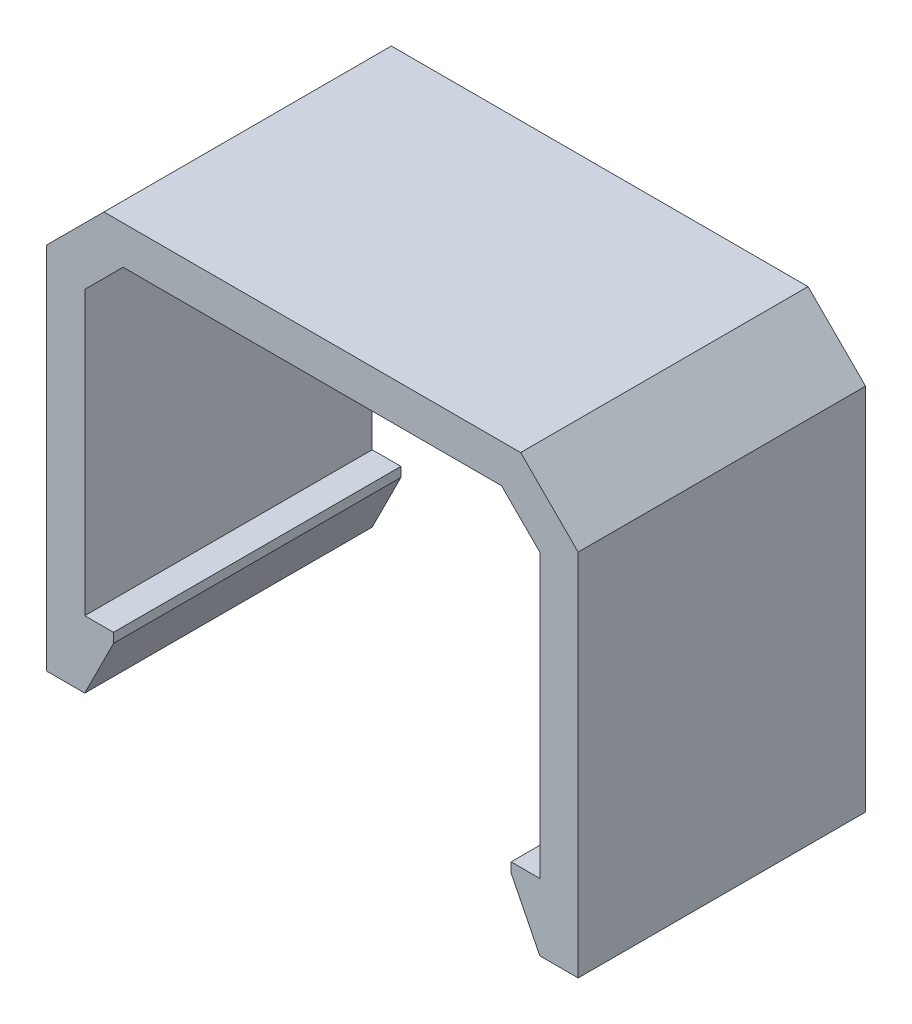
ISO-10303-21;
HEADER;
FILE_DESCRIPTION(('STEP AP214'),'2;1');
FILE_NAME('part.step','',(''),(''),'','','');
FILE_SCHEMA(('AUTOMOTIVE_DESIGN { 1 0 10303 214 1 1 1 1 }'));
ENDSEC;
DATA;
#1=APPLICATION_CONTEXT('core data for automotive mechanical design processes');
#2=APPLICATION_PROTOCOL_DEFINITION('international standard','automotive_design',2000,#1);
#3=PRODUCT_CONTEXT('',#1,'mechanical');
#4=PRODUCT('Part','Part','',(#3));
#5=PRODUCT_RELATED_PRODUCT_CATEGORY('part','',(#4));
#6=PRODUCT_DEFINITION_FORMATION('','',#4);
#7=PRODUCT_DEFINITION_CONTEXT('part definition',#1,'design');
#8=PRODUCT_DEFINITION('design','',#6,#7);
#9=PRODUCT_DEFINITION_SHAPE('','',#8);
#10=(LENGTH_UNIT() NAMED_UNIT(*) SI_UNIT(.MILLI.,.METRE.));
#11=(NAMED_UNIT(*) PLANE_ANGLE_UNIT() SI_UNIT($,.RADIAN.));
#12=(NAMED_UNIT(*) SI_UNIT($,.STERADIAN.) SOLID_ANGLE_UNIT());
#13=UNCERTAINTY_MEASURE_WITH_UNIT(LENGTH_MEASURE(1.E-05),#10,'distance_accuracy_value','');
#14=(GEOMETRIC_REPRESENTATION_CONTEXT(3) GLOBAL_UNCERTAINTY_ASSIGNED_CONTEXT((#13)) GLOBAL_UNIT_ASSIGNED_CONTEXT((#10,
#11,#12)) REPRESENTATION_CONTEXT('',''));
#15=CARTESIAN_POINT('',(0.,0.,0.));
#16=DIRECTION('',(0.,0.,1.));
#17=DIRECTION('',(1.,0.,0.));
#18=AXIS2_PLACEMENT_3D('',#15,#16,#17);
#19=CARTESIAN_POINT('',(0.,18.75,15.));
#20=DIRECTION('',(0.,-1.,0.));
#21=DIRECTION('',(0.,0.,-1.));
#22=AXIS2_PLACEMENT_3D('',#19,#20,#21);
#23=PLANE('',#22);
#24=DIRECTION('',(-1.,0.,0.));
#25=VECTOR('',#24,1.);
#26=CARTESIAN_POINT('',(0.,18.75,15.));
#27=LINE('',#26,#25);
#28=CARTESIAN_POINT('',(22.75,18.75,15.));
#29=VERTEX_POINT('',#28);
#30=CARTESIAN_POINT('',(1.00000000000001,18.75,15.));
#31=VERTEX_POINT('',#30);
#32=EDGE_CURVE('E197',#29,#31,#27,.T.);
#33=ORIENTED_EDGE('',*,*,#32,.F.);
#34=DIRECTION('',(0.,0.,-1.));
#35=VECTOR('',#34,1.);
#36=CARTESIAN_POINT('',(22.75,18.75,0.));
#37=LINE('',#36,#35);
#38=CARTESIAN_POINT('',(22.75,18.75,0.));
#39=VERTEX_POINT('',#38);
#40=EDGE_CURVE('E209',#29,#39,#37,.T.);
#41=ORIENTED_EDGE('',*,*,#40,.T.);
#42=DIRECTION('',(-1.,0.,0.));
#43=VECTOR('',#42,1.);
#44=CARTESIAN_POINT('',(0.,18.75,0.));
#45=LINE('',#44,#43);
#46=CARTESIAN_POINT('',(1.00000000000001,18.75,0.));
#47=VERTEX_POINT('',#46);
#48=EDGE_CURVE('E373',#39,#47,#45,.T.);
#49=ORIENTED_EDGE('',*,*,#48,.T.);
#50=DIRECTION('',(0.,0.,1.));
#51=VECTOR('',#50,1.);
#52=CARTESIAN_POINT('',(1.00000000000001,18.75,15.));
#53=LINE('',#52,#51);
#54=EDGE_CURVE('E204',#47,#31,#53,.T.);
#55=ORIENTED_EDGE('',*,*,#54,.T.);
#56=EDGE_LOOP('',(#33,#41,#49,#55));
#57=FACE_BOUND('',#56,.T.);
#58=ADVANCED_FACE('F47',(#57),#23,.F.);
#59=CARTESIAN_POINT('',(-2.,0.,15.));
#60=DIRECTION('',(1.,0.,0.));
#61=DIRECTION('',(0.,1.,0.));
#62=AXIS2_PLACEMENT_3D('',#59,#60,#61);
#63=PLANE('',#62);
#64=DIRECTION('',(0.,-1.,0.));
#65=VECTOR('',#64,1.);
#66=CARTESIAN_POINT('',(-2.,0.,15.));
#67=LINE('',#66,#65);
#68=CARTESIAN_POINT('',(-2.,15.75,15.));
#69=VERTEX_POINT('',#68);
#70=CARTESIAN_POINT('',(-2.,-3.5,15.));
#71=VERTEX_POINT('',#70);
#72=EDGE_CURVE('E186',#69,#71,#67,.T.);
#73=ORIENTED_EDGE('',*,*,#72,.F.);
#74=DIRECTION('',(0.,0.,-1.));
#75=VECTOR('',#74,1.);
#76=CARTESIAN_POINT('',(-2.,15.75,15.));
#77=LINE('',#76,#75);
#78=CARTESIAN_POINT('',(-2.,15.75,0.));
#79=VERTEX_POINT('',#78);
#80=EDGE_CURVE('E232',#69,#79,#77,.T.);
#81=ORIENTED_EDGE('',*,*,#80,.T.);
#82=DIRECTION('',(0.,-1.,0.));
#83=VECTOR('',#82,1.);
#84=CARTESIAN_POINT('',(-2.,0.,0.));
#85=LINE('',#84,#83);
#86=CARTESIAN_POINT('',(-2.,-3.5,0.));
#87=VERTEX_POINT('',#86);
#88=EDGE_CURVE('E202',#79,#87,#85,.T.);
#89=ORIENTED_EDGE('',*,*,#88,.T.);
#90=DIRECTION('',(0.,0.,-1.));
#91=VECTOR('',#90,1.);
#92=CARTESIAN_POINT('',(-2.,-3.5,15.));
#93=LINE('',#92,#91);
#94=EDGE_CURVE('E179',#71,#87,#93,.T.);
#95=ORIENTED_EDGE('',*,*,#94,.F.);
#96=EDGE_LOOP('',(#73,#81,#89,#95));
#97=FACE_BOUND('',#96,.T.);
#98=ADVANCED_FACE('F200',(#97),#63,.F.);
#99=CARTESIAN_POINT('',(0.,-3.5,15.));
#100=DIRECTION('',(0.,-1.,0.));
#101=DIRECTION('',(1.,0.,0.));
#102=AXIS2_PLACEMENT_3D('',#99,#100,#101);
#103=PLANE('',#102);
#104=DIRECTION('',(-1.,0.,0.));
#105=VECTOR('',#104,1.);
#106=CARTESIAN_POINT('',(0.,-3.5,0.));
#107=LINE('',#106,#105);
#108=CARTESIAN_POINT('',(0.,-3.5,0.));
#109=VERTEX_POINT('',#108);
#110=EDGE_CURVE('E341',#109,#87,#107,.T.);
#111=ORIENTED_EDGE('',*,*,#110,.F.);
#112=DIRECTION('',(0.,0.,1.));
#113=VECTOR('',#112,1.);
#114=CARTESIAN_POINT('',(0.,-3.5,15.));
#115=LINE('',#114,#113);
#116=CARTESIAN_POINT('',(0.,-3.5,15.));
#117=VERTEX_POINT('',#116);
#118=EDGE_CURVE('E181',#109,#117,#115,.T.);
#119=ORIENTED_EDGE('',*,*,#118,.T.);
#120=DIRECTION('',(-1.,0.,0.));
#121=VECTOR('',#120,1.);
#122=CARTESIAN_POINT('',(0.,-3.5,15.));
#123=LINE('',#122,#121);
#124=EDGE_CURVE('E174',#117,#71,#123,.T.);
#125=ORIENTED_EDGE('',*,*,#124,.T.);
#126=ORIENTED_EDGE('',*,*,#94,.T.);
#127=EDGE_LOOP('',(#111,#119,#125,#126));
#128=FACE_BOUND('',#127,.T.);
#129=ADVANCED_FACE('F177',(#128),#103,.T.);
#130=CARTESIAN_POINT('',(1.5,0.,15.));
#131=DIRECTION('',(1.,0.,0.));
#132=DIRECTION('',(0.,1.,0.));
#133=AXIS2_PLACEMENT_3D('',#130,#131,#132);
#134=PLANE('',#133);
#135=DIRECTION('',(0.,-1.,0.));
#136=VECTOR('',#135,1.);
#137=CARTESIAN_POINT('',(1.5,0.,15.));
#138=LINE('',#137,#136);
#139=CARTESIAN_POINT('',(1.5,0.,15.));
#140=VERTEX_POINT('',#139);
#141=CARTESIAN_POINT('',(1.5,-0.499999999999976,15.));
#142=VERTEX_POINT('',#141);
#143=EDGE_CURVE('E185',#140,#142,#138,.T.);
#144=ORIENTED_EDGE('',*,*,#143,.T.);
#145=DIRECTION('',(0.,0.,-1.));
#146=VECTOR('',#145,1.);
#147=CARTESIAN_POINT('',(1.5,-0.499999999999976,15.));
#148=LINE('',#147,#146);
#149=CARTESIAN_POINT('',(1.5,-0.499999999999976,0.));
#150=VERTEX_POINT('',#149);
#151=EDGE_CURVE('E261',#142,#150,#148,.T.);
#152=ORIENTED_EDGE('',*,*,#151,.T.);
#153=DIRECTION('',(0.,-1.,0.));
#154=VECTOR('',#153,1.);
#155=CARTESIAN_POINT('',(1.5,0.,0.));
#156=LINE('',#155,#154);
#157=CARTESIAN_POINT('',(1.5,0.,0.));
#158=VERTEX_POINT('',#157);
#159=EDGE_CURVE('E338',#158,#150,#156,.T.);
#160=ORIENTED_EDGE('',*,*,#159,.F.);
#161=DIRECTION('',(0.,0.,-1.));
#162=VECTOR('',#161,1.);
#163=CARTESIAN_POINT('',(1.5,0.,15.));
#164=LINE('',#163,#162);
#165=EDGE_CURVE('E205',#140,#158,#164,.T.);
#166=ORIENTED_EDGE('',*,*,#165,.F.);
#167=EDGE_LOOP('',(#144,#152,#160,#166));
#168=FACE_BOUND('',#167,.T.);
#169=ADVANCED_FACE('F385',(#168),#134,.T.);
#170=CARTESIAN_POINT('',(0.,0.,15.));
#171=DIRECTION('',(0.,1.,0.));
#172=DIRECTION('',(0.,0.,1.));
#173=AXIS2_PLACEMENT_3D('',#170,#171,#172);
#174=PLANE('',#173);
#175=DIRECTION('',(1.,0.,0.));
#176=VECTOR('',#175,1.);
#177=CARTESIAN_POINT('',(0.,0.,0.));
#178=LINE('',#177,#176);
#179=CARTESIAN_POINT('',(0.,0.,0.));
#180=VERTEX_POINT('',#179);
#181=EDGE_CURVE('E330',#180,#158,#178,.T.);
#182=ORIENTED_EDGE('',*,*,#181,.F.);
#183=DIRECTION('',(0.,0.,-1.));
#184=VECTOR('',#183,1.);
#185=CARTESIAN_POINT('',(0.,0.,15.));
#186=LINE('',#185,#184);
#187=CARTESIAN_POINT('',(0.,0.,15.));
#188=VERTEX_POINT('',#187);
#189=EDGE_CURVE('E211',#188,#180,#186,.T.);
#190=ORIENTED_EDGE('',*,*,#189,.F.);
#191=DIRECTION('',(1.,0.,0.));
#192=VECTOR('',#191,1.);
#193=CARTESIAN_POINT('',(0.,0.,15.));
#194=LINE('',#193,#192);
#195=EDGE_CURVE('E387',#188,#140,#194,.T.);
#196=ORIENTED_EDGE('',*,*,#195,.T.);
#197=ORIENTED_EDGE('',*,*,#165,.T.);
#198=EDGE_LOOP('',(#182,#190,#196,#197));
#199=FACE_BOUND('',#198,.T.);
#200=ADVANCED_FACE('F335',(#199),#174,.T.);
#201=CARTESIAN_POINT('',(0.,0.,15.));
#202=DIRECTION('',(-1.,0.,0.));
#203=DIRECTION('',(0.,0.,1.));
#204=AXIS2_PLACEMENT_3D('',#201,#202,#203);
#205=PLANE('',#204);
#206=DIRECTION('',(0.,1.,0.));
#207=VECTOR('',#206,1.);
#208=CARTESIAN_POINT('',(0.,0.,0.));
#209=LINE('',#208,#207);
#210=CARTESIAN_POINT('',(0.,14.75,0.));
#211=VERTEX_POINT('',#210);
#212=EDGE_CURVE('E320',#180,#211,#209,.T.);
#213=ORIENTED_EDGE('',*,*,#212,.T.);
#214=DIRECTION('',(0.,0.,1.));
#215=VECTOR('',#214,1.);
#216=CARTESIAN_POINT('',(0.,14.75,15.));
#217=LINE('',#216,#215);
#218=CARTESIAN_POINT('',(0.,14.75,15.));
#219=VERTEX_POINT('',#218);
#220=EDGE_CURVE('E246',#211,#219,#217,.T.);
#221=ORIENTED_EDGE('',*,*,#220,.T.);
#222=DIRECTION('',(0.,1.,0.));
#223=VECTOR('',#222,1.);
#224=CARTESIAN_POINT('',(0.,0.,15.));
#225=LINE('',#224,#223);
#226=EDGE_CURVE('E323',#188,#219,#225,.T.);
#227=ORIENTED_EDGE('',*,*,#226,.F.);
#228=ORIENTED_EDGE('',*,*,#189,.T.);
#229=EDGE_LOOP('',(#213,#221,#227,#228));
#230=FACE_BOUND('',#229,.T.);
#231=ADVANCED_FACE('F319',(#230),#205,.F.);
#232=CARTESIAN_POINT('',(0.,16.75,15.));
#233=DIRECTION('',(0.,1.,0.));
#234=DIRECTION('',(0.,0.,1.));
#235=AXIS2_PLACEMENT_3D('',#232,#233,#234);
#236=PLANE('',#235);
#237=DIRECTION('',(1.,0.,0.));
#238=VECTOR('',#237,1.);
#239=CARTESIAN_POINT('',(0.,16.75,0.));
#240=LINE('',#239,#238);
#241=CARTESIAN_POINT('',(2.00000000000002,16.75,0.));
#242=VERTEX_POINT('',#241);
#243=CARTESIAN_POINT('',(21.75,16.75,0.));
#244=VERTEX_POINT('',#243);
#245=EDGE_CURVE('E333',#242,#244,#240,.T.);
#246=ORIENTED_EDGE('',*,*,#245,.T.);
#247=DIRECTION('',(0.,0.,1.));
#248=VECTOR('',#247,1.);
#249=CARTESIAN_POINT('',(21.75,16.75,15.));
#250=LINE('',#249,#248);
#251=CARTESIAN_POINT('',(21.75,16.75,15.));
#252=VERTEX_POINT('',#251);
#253=EDGE_CURVE('E243',#244,#252,#250,.T.);
#254=ORIENTED_EDGE('',*,*,#253,.T.);
#255=DIRECTION('',(1.,0.,0.));
#256=VECTOR('',#255,1.);
#257=CARTESIAN_POINT('',(0.,16.75,15.));
#258=LINE('',#257,#256);
#259=CARTESIAN_POINT('',(2.00000000000002,16.75,15.));
#260=VERTEX_POINT('',#259);
#261=EDGE_CURVE('E394',#260,#252,#258,.T.);
#262=ORIENTED_EDGE('',*,*,#261,.F.);
#263=DIRECTION('',(0.,0.,-1.));
#264=VECTOR('',#263,1.);
#265=CARTESIAN_POINT('',(2.00000000000002,16.75,0.));
#266=LINE('',#265,#264);
#267=EDGE_CURVE('E239',#260,#242,#266,.T.);
#268=ORIENTED_EDGE('',*,*,#267,.T.);
#269=EDGE_LOOP('',(#246,#254,#262,#268));
#270=FACE_BOUND('',#269,.T.);
#271=ADVANCED_FACE('F406',(#270),#236,.F.);
#272=CARTESIAN_POINT('',(23.75,0.,15.));
#273=DIRECTION('',(1.,0.,0.));
#274=DIRECTION('',(0.,0.,-1.));
#275=AXIS2_PLACEMENT_3D('',#272,#273,#274);
#276=PLANE('',#275);
#277=DIRECTION('',(0.,-1.,0.));
#278=VECTOR('',#277,1.);
#279=CARTESIAN_POINT('',(23.75,0.,15.));
#280=LINE('',#279,#278);
#281=CARTESIAN_POINT('',(23.75,14.75,15.));
#282=VERTEX_POINT('',#281);
#283=CARTESIAN_POINT('',(23.75,0.,15.));
#284=VERTEX_POINT('',#283);
#285=EDGE_CURVE('E366',#282,#284,#280,.T.);
#286=ORIENTED_EDGE('',*,*,#285,.F.);
#287=DIRECTION('',(0.,0.,-1.));
#288=VECTOR('',#287,1.);
#289=CARTESIAN_POINT('',(23.75,14.75,0.));
#290=LINE('',#289,#288);
#291=CARTESIAN_POINT('',(23.75,14.75,0.));
#292=VERTEX_POINT('',#291);
#293=EDGE_CURVE('E235',#282,#292,#290,.T.);
#294=ORIENTED_EDGE('',*,*,#293,.T.);
#295=DIRECTION('',(0.,-1.,0.));
#296=VECTOR('',#295,1.);
#297=CARTESIAN_POINT('',(23.75,0.,0.));
#298=LINE('',#297,#296);
#299=CARTESIAN_POINT('',(23.75,0.,0.));
#300=VERTEX_POINT('',#299);
#301=EDGE_CURVE('E348',#292,#300,#298,.T.);
#302=ORIENTED_EDGE('',*,*,#301,.T.);
#303=DIRECTION('',(0.,0.,-1.));
#304=VECTOR('',#303,1.);
#305=CARTESIAN_POINT('',(23.75,0.,15.));
#306=LINE('',#305,#304);
#307=EDGE_CURVE('E311',#284,#300,#306,.T.);
#308=ORIENTED_EDGE('',*,*,#307,.F.);
#309=EDGE_LOOP('',(#286,#294,#302,#308));
#310=FACE_BOUND('',#309,.T.);
#311=ADVANCED_FACE('F402',(#310),#276,.F.);
#312=CARTESIAN_POINT('',(0.,0.,15.));
#313=DIRECTION('',(0.,-1.,0.));
#314=DIRECTION('',(0.,0.,-1.));
#315=AXIS2_PLACEMENT_3D('',#312,#313,#314);
#316=PLANE('',#315);
#317=DIRECTION('',(-1.,0.,0.));
#318=VECTOR('',#317,1.);
#319=CARTESIAN_POINT('',(0.,0.,0.));
#320=LINE('',#319,#318);
#321=CARTESIAN_POINT('',(22.25,0.,0.));
#322=VERTEX_POINT('',#321);
#323=EDGE_CURVE('E299',#300,#322,#320,.T.);
#324=ORIENTED_EDGE('',*,*,#323,.T.);
#325=DIRECTION('',(0.,0.,-1.));
#326=VECTOR('',#325,1.);
#327=CARTESIAN_POINT('',(22.25,0.,15.));
#328=LINE('',#327,#326);
#329=CARTESIAN_POINT('',(22.25,0.,15.));
#330=VERTEX_POINT('',#329);
#331=EDGE_CURVE('E306',#330,#322,#328,.T.);
#332=ORIENTED_EDGE('',*,*,#331,.F.);
#333=DIRECTION('',(-1.,0.,0.));
#334=VECTOR('',#333,1.);
#335=CARTESIAN_POINT('',(0.,0.,15.));
#336=LINE('',#335,#334);
#337=EDGE_CURVE('E361',#284,#330,#336,.T.);
#338=ORIENTED_EDGE('',*,*,#337,.F.);
#339=ORIENTED_EDGE('',*,*,#307,.T.);
#340=EDGE_LOOP('',(#324,#332,#338,#339));
#341=FACE_BOUND('',#340,.T.);
#342=ADVANCED_FACE('F354',(#341),#316,.F.);
#343=CARTESIAN_POINT('',(22.25,0.,15.));
#344=DIRECTION('',(1.,0.,0.));
#345=DIRECTION('',(0.,1.,0.));
#346=AXIS2_PLACEMENT_3D('',#343,#344,#345);
#347=PLANE('',#346);
#348=DIRECTION('',(0.,-1.,0.));
#349=VECTOR('',#348,1.);
#350=CARTESIAN_POINT('',(22.25,0.,0.));
#351=LINE('',#350,#349);
#352=CARTESIAN_POINT('',(22.25,-0.499999999999983,0.));
#353=VERTEX_POINT('',#352);
#354=EDGE_CURVE('E294',#322,#353,#351,.T.);
#355=ORIENTED_EDGE('',*,*,#354,.T.);
#356=DIRECTION('',(0.,0.,1.));
#357=VECTOR('',#356,1.);
#358=CARTESIAN_POINT('',(22.25,-0.499999999999983,15.));
#359=LINE('',#358,#357);
#360=CARTESIAN_POINT('',(22.25,-0.499999999999983,15.));
#361=VERTEX_POINT('',#360);
#362=EDGE_CURVE('E57',#353,#361,#359,.T.);
#363=ORIENTED_EDGE('',*,*,#362,.T.);
#364=DIRECTION('',(0.,-1.,0.));
#365=VECTOR('',#364,1.);
#366=CARTESIAN_POINT('',(22.25,0.,15.));
#367=LINE('',#366,#365);
#368=EDGE_CURVE('E359',#330,#361,#367,.T.);
#369=ORIENTED_EDGE('',*,*,#368,.F.);
#370=ORIENTED_EDGE('',*,*,#331,.T.);
#371=EDGE_LOOP('',(#355,#363,#369,#370));
#372=FACE_BOUND('',#371,.T.);
#373=ADVANCED_FACE('F358',(#372),#347,.F.);
#374=CARTESIAN_POINT('',(0.,-3.5,15.));
#375=DIRECTION('',(0.,1.,0.));
#376=DIRECTION('',(-1.,0.,0.));
#377=AXIS2_PLACEMENT_3D('',#374,#375,#376);
#378=PLANE('',#377);
#379=DIRECTION('',(1.,0.,0.));
#380=VECTOR('',#379,1.);
#381=CARTESIAN_POINT('',(0.,-3.5,15.));
#382=LINE('',#381,#380);
#383=CARTESIAN_POINT('',(23.75,-3.5,15.));
#384=VERTEX_POINT('',#383);
#385=CARTESIAN_POINT('',(25.75,-3.5,15.));
#386=VERTEX_POINT('',#385);
#387=EDGE_CURVE('E286',#384,#386,#382,.T.);
#388=ORIENTED_EDGE('',*,*,#387,.F.);
#389=DIRECTION('',(0.,0.,-1.));
#390=VECTOR('',#389,1.);
#391=CARTESIAN_POINT('',(23.75,-3.5,15.));
#392=LINE('',#391,#390);
#393=CARTESIAN_POINT('',(23.75,-3.5,0.));
#394=VERTEX_POINT('',#393);
#395=EDGE_CURVE('E273',#384,#394,#392,.T.);
#396=ORIENTED_EDGE('',*,*,#395,.T.);
#397=DIRECTION('',(1.,0.,0.));
#398=VECTOR('',#397,1.);
#399=CARTESIAN_POINT('',(0.,-3.5,0.));
#400=LINE('',#399,#398);
#401=CARTESIAN_POINT('',(25.75,-3.5,0.));
#402=VERTEX_POINT('',#401);
#403=EDGE_CURVE('E284',#394,#402,#400,.T.);
#404=ORIENTED_EDGE('',*,*,#403,.T.);
#405=DIRECTION('',(0.,0.,-1.));
#406=VECTOR('',#405,1.);
#407=CARTESIAN_POINT('',(25.75,-3.5,15.));
#408=LINE('',#407,#406);
#409=EDGE_CURVE('E303',#386,#402,#408,.T.);
#410=ORIENTED_EDGE('',*,*,#409,.F.);
#411=EDGE_LOOP('',(#388,#396,#404,#410));
#412=FACE_BOUND('',#411,.T.);
#413=ADVANCED_FACE('F282',(#412),#378,.F.);
#414=CARTESIAN_POINT('',(25.75,0.,15.));
#415=DIRECTION('',(1.,0.,0.));
#416=DIRECTION('',(0.,1.,0.));
#417=AXIS2_PLACEMENT_3D('',#414,#415,#416);
#418=PLANE('',#417);
#419=DIRECTION('',(0.,-1.,0.));
#420=VECTOR('',#419,1.);
#421=CARTESIAN_POINT('',(25.75,0.,0.));
#422=LINE('',#421,#420);
#423=CARTESIAN_POINT('',(25.75,15.75,0.));
#424=VERTEX_POINT('',#423);
#425=EDGE_CURVE('E291',#424,#402,#422,.T.);
#426=ORIENTED_EDGE('',*,*,#425,.F.);
#427=DIRECTION('',(0.,0.,1.));
#428=VECTOR('',#427,1.);
#429=CARTESIAN_POINT('',(25.75,15.75,15.));
#430=LINE('',#429,#428);
#431=CARTESIAN_POINT('',(25.75,15.75,15.));
#432=VERTEX_POINT('',#431);
#433=EDGE_CURVE('E224',#424,#432,#430,.T.);
#434=ORIENTED_EDGE('',*,*,#433,.T.);
#435=DIRECTION('',(0.,-1.,0.));
#436=VECTOR('',#435,1.);
#437=CARTESIAN_POINT('',(25.75,0.,15.));
#438=LINE('',#437,#436);
#439=EDGE_CURVE('E307',#432,#386,#438,.T.);
#440=ORIENTED_EDGE('',*,*,#439,.T.);
#441=ORIENTED_EDGE('',*,*,#409,.T.);
#442=EDGE_LOOP('',(#426,#434,#440,#441));
#443=FACE_BOUND('',#442,.T.);
#444=ADVANCED_FACE('F461',(#443),#418,.T.);
#445=CARTESIAN_POINT('',(0.,0.,15.));
#446=DIRECTION('',(0.,0.,1.));
#447=DIRECTION('',(1.,0.,0.));
#448=AXIS2_PLACEMENT_3D('',#445,#446,#447);
#449=PLANE('',#448);
#450=ORIENTED_EDGE('',*,*,#368,.T.);
#451=DIRECTION('',(-0.447213595499955,0.894427190999917,0.));
#452=VECTOR('',#451,1.);
#453=CARTESIAN_POINT('',(17.6000000000001,8.79999999999997,15.));
#454=LINE('',#453,#452);
#455=EDGE_CURVE('E11',#361,#384,#454,.F.);
#456=ORIENTED_EDGE('',*,*,#455,.T.);
#457=ORIENTED_EDGE('',*,*,#387,.T.);
#458=ORIENTED_EDGE('',*,*,#439,.F.);
#459=DIRECTION('',(-0.707106781186546,0.707106781186549,0.));
#460=VECTOR('',#459,1.);
#461=CARTESIAN_POINT('',(20.75,20.75,15.));
#462=LINE('',#461,#460);
#463=EDGE_CURVE('E229',#432,#29,#462,.T.);
#464=ORIENTED_EDGE('',*,*,#463,.T.);
#465=ORIENTED_EDGE('',*,*,#32,.T.);
#466=DIRECTION('',(0.707106781186549,0.707106781186546,0.));
#467=VECTOR('',#466,1.);
#468=CARTESIAN_POINT('',(-8.875,8.87500000000003,15.));
#469=LINE('',#468,#467);
#470=EDGE_CURVE('E192',#31,#69,#469,.F.);
#471=ORIENTED_EDGE('',*,*,#470,.T.);
#472=ORIENTED_EDGE('',*,*,#72,.T.);
#473=ORIENTED_EDGE('',*,*,#124,.F.);
#474=DIRECTION('',(-0.447213595499955,-0.894427190999917,0.));
#475=VECTOR('',#474,1.);
#476=CARTESIAN_POINT('',(1.39999999999999,-0.699999999999992,15.));
#477=LINE('',#476,#475);
#478=EDGE_CURVE('E270',#117,#142,#477,.F.);
#479=ORIENTED_EDGE('',*,*,#478,.T.);
#480=ORIENTED_EDGE('',*,*,#143,.F.);
#481=ORIENTED_EDGE('',*,*,#195,.F.);
#482=ORIENTED_EDGE('',*,*,#226,.T.);
#483=DIRECTION('',(-0.707106781186551,-0.707106781186544,0.));
#484=VECTOR('',#483,1.);
#485=CARTESIAN_POINT('',(2.00000000000002,16.75,15.));
#486=LINE('',#485,#484);
#487=EDGE_CURVE('E258',#219,#260,#486,.F.);
#488=ORIENTED_EDGE('',*,*,#487,.T.);
#489=ORIENTED_EDGE('',*,*,#261,.T.);
#490=DIRECTION('',(-0.707106781186544,0.707106781186551,0.));
#491=VECTOR('',#490,1.);
#492=CARTESIAN_POINT('',(23.75,14.75,15.));
#493=LINE('',#492,#491);
#494=EDGE_CURVE('E252',#252,#282,#493,.F.);
#495=ORIENTED_EDGE('',*,*,#494,.T.);
#496=ORIENTED_EDGE('',*,*,#285,.T.);
#497=ORIENTED_EDGE('',*,*,#337,.T.);
#498=EDGE_LOOP('',(#450,#456,#457,#458,#464,#465,#471,#472,#473,#479,#480,#481,#482,#488,#489,
#495,#496,#497));
#499=FACE_BOUND('',#498,.T.);
#500=ADVANCED_FACE('F189',(#499),#449,.T.);
#501=CARTESIAN_POINT('',(0.,0.,0.));
#502=DIRECTION('',(0.,0.,1.));
#503=DIRECTION('',(1.,0.,0.));
#504=AXIS2_PLACEMENT_3D('',#501,#502,#503);
#505=PLANE('',#504);
#506=ORIENTED_EDGE('',*,*,#403,.F.);
#507=DIRECTION('',(0.447213595499955,-0.894427190999917,0.));
#508=VECTOR('',#507,1.);
#509=CARTESIAN_POINT('',(23.75,-3.5,0.));
#510=LINE('',#509,#508);
#511=EDGE_CURVE('E71',#394,#353,#510,.F.);
#512=ORIENTED_EDGE('',*,*,#511,.T.);
#513=ORIENTED_EDGE('',*,*,#354,.F.);
#514=ORIENTED_EDGE('',*,*,#323,.F.);
#515=ORIENTED_EDGE('',*,*,#301,.F.);
#516=DIRECTION('',(0.707106781186544,-0.707106781186551,0.));
#517=VECTOR('',#516,1.);
#518=CARTESIAN_POINT('',(19.2500000000001,19.2499999999999,0.));
#519=LINE('',#518,#517);
#520=EDGE_CURVE('E249',#292,#244,#519,.F.);
#521=ORIENTED_EDGE('',*,*,#520,.T.);
#522=ORIENTED_EDGE('',*,*,#245,.F.);
#523=DIRECTION('',(0.707106781186551,0.707106781186544,0.));
#524=VECTOR('',#523,1.);
#525=CARTESIAN_POINT('',(-7.375,7.37500000000007,0.));
#526=LINE('',#525,#524);
#527=EDGE_CURVE('E255',#242,#211,#526,.F.);
#528=ORIENTED_EDGE('',*,*,#527,.T.);
#529=ORIENTED_EDGE('',*,*,#212,.F.);
#530=ORIENTED_EDGE('',*,*,#181,.T.);
#531=ORIENTED_EDGE('',*,*,#159,.T.);
#532=DIRECTION('',(0.447213595499955,0.894427190999917,0.));
#533=VECTOR('',#532,1.);
#534=CARTESIAN_POINT('',(1.5,-0.499999999999976,0.));
#535=LINE('',#534,#533);
#536=EDGE_CURVE('E265',#150,#109,#535,.F.);
#537=ORIENTED_EDGE('',*,*,#536,.T.);
#538=ORIENTED_EDGE('',*,*,#110,.T.);
#539=ORIENTED_EDGE('',*,*,#88,.F.);
#540=DIRECTION('',(-0.707106781186549,-0.707106781186546,0.));
#541=VECTOR('',#540,1.);
#542=CARTESIAN_POINT('',(-2.,15.75,0.));
#543=LINE('',#542,#541);
#544=EDGE_CURVE('E218',#79,#47,#543,.F.);
#545=ORIENTED_EDGE('',*,*,#544,.T.);
#546=ORIENTED_EDGE('',*,*,#48,.F.);
#547=DIRECTION('',(0.707106781186546,-0.707106781186549,0.));
#548=VECTOR('',#547,1.);
#549=CARTESIAN_POINT('',(22.75,18.75,0.));
#550=LINE('',#549,#548);
#551=EDGE_CURVE('E221',#39,#424,#550,.T.);
#552=ORIENTED_EDGE('',*,*,#551,.T.);
#553=ORIENTED_EDGE('',*,*,#425,.T.);
#554=EDGE_LOOP('',(#506,#512,#513,#514,#515,#521,#522,#528,#529,#530,#531,#537,#538,#539,#545,
#546,#552,#553));
#555=FACE_BOUND('',#554,.T.);
#556=ADVANCED_FACE('F289',(#555),#505,.F.);
#557=CARTESIAN_POINT('',(22.75,18.75,15.));
#558=DIRECTION('',(0.707106781186549,0.707106781186546,0.));
#559=DIRECTION('',(0.,0.,1.));
#560=AXIS2_PLACEMENT_3D('',#557,#558,#559);
#561=PLANE('',#560);
#562=ORIENTED_EDGE('',*,*,#463,.F.);
#563=ORIENTED_EDGE('',*,*,#433,.F.);
#564=ORIENTED_EDGE('',*,*,#551,.F.);
#565=ORIENTED_EDGE('',*,*,#40,.F.);
#566=EDGE_LOOP('',(#562,#563,#564,#565));
#567=FACE_BOUND('',#566,.T.);
#568=ADVANCED_FACE('F420',(#567),#561,.T.);
#569=CARTESIAN_POINT('',(-2.,15.75,15.));
#570=DIRECTION('',(0.707106781186546,-0.707106781186549,0.));
#571=DIRECTION('',(0.,0.,-1.));
#572=AXIS2_PLACEMENT_3D('',#569,#570,#571);
#573=PLANE('',#572);
#574=ORIENTED_EDGE('',*,*,#470,.F.);
#575=ORIENTED_EDGE('',*,*,#54,.F.);
#576=ORIENTED_EDGE('',*,*,#544,.F.);
#577=ORIENTED_EDGE('',*,*,#80,.F.);
#578=EDGE_LOOP('',(#574,#575,#576,#577));
#579=FACE_BOUND('',#578,.T.);
#580=ADVANCED_FACE('F412',(#579),#573,.F.);
#581=CARTESIAN_POINT('',(23.75,14.75,15.));
#582=DIRECTION('',(-0.707106781186551,-0.707106781186544,0.));
#583=DIRECTION('',(0.,0.,1.));
#584=AXIS2_PLACEMENT_3D('',#581,#582,#583);
#585=PLANE('',#584);
#586=ORIENTED_EDGE('',*,*,#494,.F.);
#587=ORIENTED_EDGE('',*,*,#253,.F.);
#588=ORIENTED_EDGE('',*,*,#520,.F.);
#589=ORIENTED_EDGE('',*,*,#293,.F.);
#590=EDGE_LOOP('',(#586,#587,#588,#589));
#591=FACE_BOUND('',#590,.T.);
#592=ADVANCED_FACE('F409',(#591),#585,.T.);
#593=CARTESIAN_POINT('',(2.00000000000002,16.75,15.));
#594=DIRECTION('',(0.707106781186544,-0.707106781186551,0.));
#595=DIRECTION('',(0.,0.,1.));
#596=AXIS2_PLACEMENT_3D('',#593,#594,#595);
#597=PLANE('',#596);
#598=ORIENTED_EDGE('',*,*,#487,.F.);
#599=ORIENTED_EDGE('',*,*,#220,.F.);
#600=ORIENTED_EDGE('',*,*,#527,.F.);
#601=ORIENTED_EDGE('',*,*,#267,.F.);
#602=EDGE_LOOP('',(#598,#599,#600,#601));
#603=FACE_BOUND('',#602,.T.);
#604=ADVANCED_FACE('F411',(#603),#597,.T.);
#605=CARTESIAN_POINT('',(1.5,-0.499999999999976,15.));
#606=DIRECTION('',(-0.894427190999917,0.447213595499955,0.));
#607=DIRECTION('',(0.,0.,-1.));
#608=AXIS2_PLACEMENT_3D('',#605,#606,#607);
#609=PLANE('',#608);
#610=ORIENTED_EDGE('',*,*,#478,.F.);
#611=ORIENTED_EDGE('',*,*,#118,.F.);
#612=ORIENTED_EDGE('',*,*,#536,.F.);
#613=ORIENTED_EDGE('',*,*,#151,.F.);
#614=EDGE_LOOP('',(#610,#611,#612,#613));
#615=FACE_BOUND('',#614,.T.);
#616=ADVANCED_FACE('F380',(#615),#609,.F.);
#617=CARTESIAN_POINT('',(23.75,-3.5,15.));
#618=DIRECTION('',(0.894427190999917,0.447213595499955,0.));
#619=DIRECTION('',(0.,0.,-1.));
#620=AXIS2_PLACEMENT_3D('',#617,#618,#619);
#621=PLANE('',#620);
#622=ORIENTED_EDGE('',*,*,#455,.F.);
#623=ORIENTED_EDGE('',*,*,#362,.F.);
#624=ORIENTED_EDGE('',*,*,#511,.F.);
#625=ORIENTED_EDGE('',*,*,#395,.F.);
#626=EDGE_LOOP('',(#622,#623,#624,#625));
#627=FACE_BOUND('',#626,.T.);
#628=ADVANCED_FACE('F50',(#627),#621,.F.);
#629=CLOSED_SHELL('',(#58,#98,#129,#169,#200,#231,#271,#311,#342,#373,#413,#444,#500,#556,#568,
#580,#592,#604,#616,#628));
#630=MANIFOLD_SOLID_BREP('B2',#629);
#631=ADVANCED_BREP_SHAPE_REPRESENTATION('',(#18,#630),#14);
#632=SHAPE_DEFINITION_REPRESENTATION(#9,#631);
ENDSEC;
END-ISO-10303-21;
